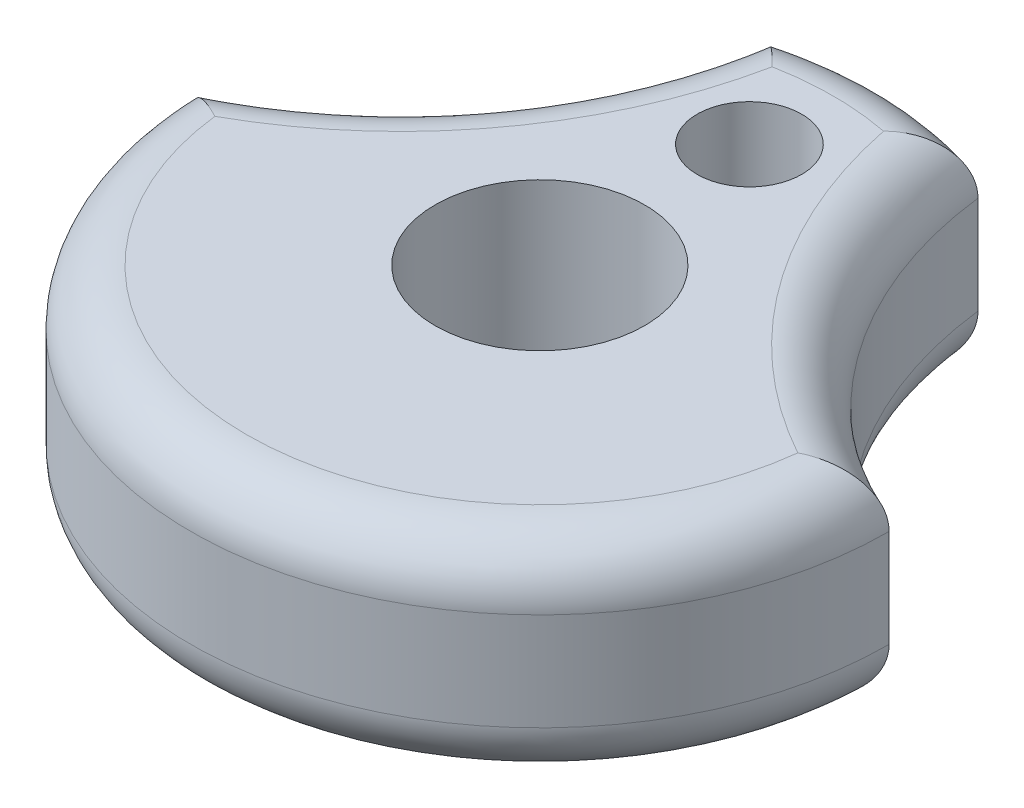
ISO-10303-21;
HEADER;
FILE_DESCRIPTION(('STEP AP214'),'2;1');
FILE_NAME('part.step','',(''),(''),'','','');
FILE_SCHEMA(('AUTOMOTIVE_DESIGN { 1 0 10303 214 1 1 1 1 }'));
ENDSEC;
DATA;
#1=APPLICATION_CONTEXT('core data for automotive mechanical design processes');
#2=APPLICATION_PROTOCOL_DEFINITION('international standard','automotive_design',2000,#1);
#3=PRODUCT_CONTEXT('',#1,'mechanical');
#4=PRODUCT('Part','Part','',(#3));
#5=PRODUCT_RELATED_PRODUCT_CATEGORY('part','',(#4));
#6=PRODUCT_DEFINITION_FORMATION('','',#4);
#7=PRODUCT_DEFINITION_CONTEXT('part definition',#1,'design');
#8=PRODUCT_DEFINITION('design','',#6,#7);
#9=PRODUCT_DEFINITION_SHAPE('','',#8);
#10=(LENGTH_UNIT() NAMED_UNIT(*) SI_UNIT(.MILLI.,.METRE.));
#11=(NAMED_UNIT(*) PLANE_ANGLE_UNIT() SI_UNIT($,.RADIAN.));
#12=(NAMED_UNIT(*) SI_UNIT($,.STERADIAN.) SOLID_ANGLE_UNIT());
#13=UNCERTAINTY_MEASURE_WITH_UNIT(LENGTH_MEASURE(1.E-05),#10,'distance_accuracy_value','');
#14=(GEOMETRIC_REPRESENTATION_CONTEXT(3) GLOBAL_UNCERTAINTY_ASSIGNED_CONTEXT((#13)) GLOBAL_UNIT_ASSIGNED_CONTEXT((#10,
#11,#12)) REPRESENTATION_CONTEXT('',''));
#15=CARTESIAN_POINT('',(0.,0.,0.));
#16=DIRECTION('',(0.,0.,1.));
#17=DIRECTION('',(1.,0.,0.));
#18=AXIS2_PLACEMENT_3D('',#15,#16,#17);
#19=CARTESIAN_POINT('',(-11.847019191903,4.7625,-8.68569425481592));
#20=DIRECTION('',(0.,1.,0.));
#21=DIRECTION('',(0.,0.,1.));
#22=AXIS2_PLACEMENT_3D('',#19,#20,#21);
#23=PLANE('',#22);
#24=CARTESIAN_POINT('',(0.,4.7625,0.));
#25=DIRECTION('',(0.,1.,0.));
#26=DIRECTION('',(0.,0.,1.));
#27=AXIS2_PLACEMENT_3D('',#24,#25,#26);
#28=CIRCLE('',#27,13.335);
#29=CARTESIAN_POINT('',(-13.247728473695,4.7625,1.52312681259641));
#30=VERTEX_POINT('',#29);
#31=CARTESIAN_POINT('',(13.247728473695,4.7625,1.52312681259641));
#32=VERTEX_POINT('',#31);
#33=EDGE_CURVE('E65',#30,#32,#28,.T.);
#34=ORIENTED_EDGE('',*,*,#33,.T.);
#35=CARTESIAN_POINT('',(23.6940383838059,4.7625,-17.3713885096318));
#36=DIRECTION('',(0.,1.,0.));
#37=DIRECTION('',(0.,0.,1.));
#38=AXIS2_PLACEMENT_3D('',#35,#36,#37);
#39=CIRCLE('',#38,21.59);
#40=CARTESIAN_POINT('',(2.53233011221546,4.7625,-13.0923462069549));
#41=VERTEX_POINT('',#40);
#42=EDGE_CURVE('E11',#32,#41,#39,.F.);
#43=ORIENTED_EDGE('',*,*,#42,.T.);
#44=CARTESIAN_POINT('',(0.,4.7625,0.));
#45=DIRECTION('',(0.,1.,0.));
#46=DIRECTION('',(0.,0.,1.));
#47=AXIS2_PLACEMENT_3D('',#44,#45,#46);
#48=CIRCLE('',#47,13.335);
#49=CARTESIAN_POINT('',(-2.53233011221546,4.7625,-13.0923462069549));
#50=VERTEX_POINT('',#49);
#51=EDGE_CURVE('E50',#41,#50,#48,.T.);
#52=ORIENTED_EDGE('',*,*,#51,.T.);
#53=CARTESIAN_POINT('',(-23.6940383838059,4.7625,-17.3713885096318));
#54=DIRECTION('',(0.,1.,0.));
#55=DIRECTION('',(0.,0.,1.));
#56=AXIS2_PLACEMENT_3D('',#53,#54,#55);
#57=CIRCLE('',#56,21.59);
#58=EDGE_CURVE('E137',#50,#30,#57,.F.);
#59=ORIENTED_EDGE('',*,*,#58,.T.);
#60=EDGE_LOOP('',(#34,#43,#52,#59));
#61=FACE_BOUND('',#60,.T.);
#62=CARTESIAN_POINT('',(0.,4.7625,0.));
#63=DIRECTION('',(0.,1.,0.));
#64=DIRECTION('',(0.,0.,1.));
#65=AXIS2_PLACEMENT_3D('',#62,#63,#64);
#66=CIRCLE('',#65,4.7625);
#67=CARTESIAN_POINT('',(0.,4.7625,4.7625));
#68=VERTEX_POINT('',#67);
#69=EDGE_CURVE('E344',#68,#68,#66,.T.);
#70=ORIENTED_EDGE('',*,*,#69,.F.);
#71=EDGE_LOOP('',(#70));
#72=FACE_BOUND('',#71,.T.);
#73=CARTESIAN_POINT('',(0.,4.7625,-9.525));
#74=DIRECTION('',(0.,1.,0.));
#75=DIRECTION('',(0.,0.,1.));
#76=AXIS2_PLACEMENT_3D('',#73,#74,#75);
#77=CIRCLE('',#76,2.3749);
#78=CARTESIAN_POINT('',(0.,4.7625,-7.1501));
#79=VERTEX_POINT('',#78);
#80=EDGE_CURVE('E350',#79,#79,#77,.T.);
#81=ORIENTED_EDGE('',*,*,#80,.F.);
#82=EDGE_LOOP('',(#81));
#83=FACE_BOUND('',#82,.T.);
#84=ADVANCED_FACE('F36',(#61,#72,#83),#23,.T.);
#85=CARTESIAN_POINT('',(-11.847019191903,-4.7625,-8.68569425481592));
#86=DIRECTION('',(0.,1.,0.));
#87=DIRECTION('',(0.,0.,1.));
#88=AXIS2_PLACEMENT_3D('',#85,#86,#87);
#89=PLANE('',#88);
#90=CARTESIAN_POINT('',(-23.6940383838059,-4.7625,-17.3713885096318));
#91=DIRECTION('',(0.,1.,0.));
#92=DIRECTION('',(0.,0.,1.));
#93=AXIS2_PLACEMENT_3D('',#90,#91,#92);
#94=CIRCLE('',#93,21.59);
#95=CARTESIAN_POINT('',(-13.247728473695,-4.7625,1.52312681259641));
#96=VERTEX_POINT('',#95);
#97=CARTESIAN_POINT('',(-2.53233011221546,-4.7625,-13.0923462069549));
#98=VERTEX_POINT('',#97);
#99=EDGE_CURVE('E149',#96,#98,#94,.T.);
#100=ORIENTED_EDGE('',*,*,#99,.T.);
#101=CARTESIAN_POINT('',(0.,-4.7625,0.));
#102=DIRECTION('',(0.,1.,0.));
#103=DIRECTION('',(0.,0.,1.));
#104=AXIS2_PLACEMENT_3D('',#101,#102,#103);
#105=CIRCLE('',#104,13.335);
#106=CARTESIAN_POINT('',(2.53233011221546,-4.7625,-13.0923462069549));
#107=VERTEX_POINT('',#106);
#108=EDGE_CURVE('E122',#98,#107,#105,.F.);
#109=ORIENTED_EDGE('',*,*,#108,.T.);
#110=CARTESIAN_POINT('',(23.6940383838059,-4.7625,-17.3713885096318));
#111=DIRECTION('',(0.,1.,0.));
#112=DIRECTION('',(0.,0.,1.));
#113=AXIS2_PLACEMENT_3D('',#110,#111,#112);
#114=CIRCLE('',#113,21.59);
#115=CARTESIAN_POINT('',(13.247728473695,-4.7625,1.52312681259641));
#116=VERTEX_POINT('',#115);
#117=EDGE_CURVE('E147',#107,#116,#114,.T.);
#118=ORIENTED_EDGE('',*,*,#117,.T.);
#119=CARTESIAN_POINT('',(0.,-4.7625,0.));
#120=DIRECTION('',(0.,1.,0.));
#121=DIRECTION('',(0.,0.,1.));
#122=AXIS2_PLACEMENT_3D('',#119,#120,#121);
#123=CIRCLE('',#122,13.335);
#124=EDGE_CURVE('E142',#116,#96,#123,.F.);
#125=ORIENTED_EDGE('',*,*,#124,.T.);
#126=EDGE_LOOP('',(#100,#109,#118,#125));
#127=FACE_BOUND('',#126,.T.);
#128=CARTESIAN_POINT('',(0.,-4.7625,0.));
#129=DIRECTION('',(0.,1.,0.));
#130=DIRECTION('',(0.,0.,1.));
#131=AXIS2_PLACEMENT_3D('',#128,#129,#130);
#132=CIRCLE('',#131,4.7625);
#133=CARTESIAN_POINT('',(0.,-4.7625,4.7625));
#134=VERTEX_POINT('',#133);
#135=EDGE_CURVE('E347',#134,#134,#132,.T.);
#136=ORIENTED_EDGE('',*,*,#135,.T.);
#137=EDGE_LOOP('',(#136));
#138=FACE_BOUND('',#137,.T.);
#139=CARTESIAN_POINT('',(0.,-4.7625,-9.525));
#140=DIRECTION('',(0.,1.,0.));
#141=DIRECTION('',(0.,0.,1.));
#142=AXIS2_PLACEMENT_3D('',#139,#140,#141);
#143=CIRCLE('',#142,2.3749);
#144=CARTESIAN_POINT('',(0.,-4.7625,-7.1501));
#145=VERTEX_POINT('',#144);
#146=EDGE_CURVE('E206',#145,#145,#143,.T.);
#147=ORIENTED_EDGE('',*,*,#146,.T.);
#148=EDGE_LOOP('',(#147));
#149=FACE_BOUND('',#148,.T.);
#150=ADVANCED_FACE('F240',(#127,#138,#149),#89,.F.);
#151=CARTESIAN_POINT('',(0.,4.7625,0.));
#152=DIRECTION('',(0.,-1.,0.));
#153=DIRECTION('',(0.,0.,-1.));
#154=AXIS2_PLACEMENT_3D('',#151,#152,#153);
#155=CYLINDRICAL_SURFACE('',#154,15.875);
#156=DIRECTION('',(0.,-1.,0.));
#157=VECTOR('',#156,1.);
#158=CARTESIAN_POINT('',(4.7752,4.7625,-15.1397850037575));
#159=LINE('',#158,#157);
#160=CARTESIAN_POINT('',(4.7752,2.2225,-15.1397850037575));
#161=VERTEX_POINT('',#160);
#162=CARTESIAN_POINT('',(4.7752,-2.2225,-15.1397850037575));
#163=VERTEX_POINT('',#162);
#164=EDGE_CURVE('E341',#161,#163,#159,.T.);
#165=ORIENTED_EDGE('',*,*,#164,.T.);
#166=CARTESIAN_POINT('',(0.,-2.2225,0.));
#167=DIRECTION('',(0.,1.,0.));
#168=DIRECTION('',(0.,0.,1.));
#169=AXIS2_PLACEMENT_3D('',#166,#167,#168);
#170=CIRCLE('',#169,15.875);
#171=CARTESIAN_POINT('',(-4.7752,-2.2225,-15.1397850037575));
#172=VERTEX_POINT('',#171);
#173=EDGE_CURVE('E132',#163,#172,#170,.T.);
#174=ORIENTED_EDGE('',*,*,#173,.T.);
#175=DIRECTION('',(0.,-1.,0.));
#176=VECTOR('',#175,1.);
#177=CARTESIAN_POINT('',(-4.7752,4.7625,-15.1397850037575));
#178=LINE('',#177,#176);
#179=CARTESIAN_POINT('',(-4.7752,2.2225,-15.1397850037575));
#180=VERTEX_POINT('',#179);
#181=EDGE_CURVE('E114',#180,#172,#178,.T.);
#182=ORIENTED_EDGE('',*,*,#181,.F.);
#183=CARTESIAN_POINT('',(0.,2.2225,0.));
#184=DIRECTION('',(0.,1.,0.));
#185=DIRECTION('',(0.,0.,1.));
#186=AXIS2_PLACEMENT_3D('',#183,#184,#185);
#187=CIRCLE('',#186,15.875);
#188=EDGE_CURVE('E129',#180,#161,#187,.F.);
#189=ORIENTED_EDGE('',*,*,#188,.T.);
#190=EDGE_LOOP('',(#165,#174,#182,#189));
#191=FACE_BOUND('',#190,.T.);
#192=ADVANCED_FACE('F127',(#191),#155,.T.);
#193=CARTESIAN_POINT('',(-23.6940383838059,4.7625,-17.3713885096318));
#194=DIRECTION('',(0.,-1.,0.));
#195=DIRECTION('',(0.,0.,-1.));
#196=AXIS2_PLACEMENT_3D('',#193,#194,#195);
#197=CYLINDRICAL_SURFACE('',#196,19.05);
#198=ORIENTED_EDGE('',*,*,#181,.T.);
#199=CARTESIAN_POINT('',(-23.6940383838059,-2.2225,-17.3713885096318));
#200=DIRECTION('',(0.,1.,0.));
#201=DIRECTION('',(0.,0.,1.));
#202=AXIS2_PLACEMENT_3D('',#199,#200,#201);
#203=CIRCLE('',#202,19.05);
#204=CARTESIAN_POINT('',(-15.875,-2.2225,0.));
#205=VERTEX_POINT('',#204);
#206=EDGE_CURVE('E121',#172,#205,#203,.F.);
#207=ORIENTED_EDGE('',*,*,#206,.T.);
#208=DIRECTION('',(0.,-1.,0.));
#209=VECTOR('',#208,1.);
#210=CARTESIAN_POINT('',(-15.875,4.7625,0.));
#211=LINE('',#210,#209);
#212=CARTESIAN_POINT('',(-15.875,2.2225,0.));
#213=VERTEX_POINT('',#212);
#214=EDGE_CURVE('E116',#213,#205,#211,.T.);
#215=ORIENTED_EDGE('',*,*,#214,.F.);
#216=CARTESIAN_POINT('',(-23.6940383838059,2.2225,-17.3713885096318));
#217=DIRECTION('',(0.,1.,0.));
#218=DIRECTION('',(0.,0.,1.));
#219=AXIS2_PLACEMENT_3D('',#216,#217,#218);
#220=CIRCLE('',#219,19.05);
#221=EDGE_CURVE('E111',#213,#180,#220,.T.);
#222=ORIENTED_EDGE('',*,*,#221,.T.);
#223=EDGE_LOOP('',(#198,#207,#215,#222));
#224=FACE_BOUND('',#223,.T.);
#225=ADVANCED_FACE('F113',(#224),#197,.F.);
#226=CARTESIAN_POINT('',(0.,4.7625,0.));
#227=DIRECTION('',(0.,-1.,0.));
#228=DIRECTION('',(0.,0.,-1.));
#229=AXIS2_PLACEMENT_3D('',#226,#227,#228);
#230=CYLINDRICAL_SURFACE('',#229,15.875);
#231=ORIENTED_EDGE('',*,*,#214,.T.);
#232=CARTESIAN_POINT('',(0.,-2.2225,0.));
#233=DIRECTION('',(0.,1.,0.));
#234=DIRECTION('',(0.,0.,1.));
#235=AXIS2_PLACEMENT_3D('',#232,#233,#234);
#236=CIRCLE('',#235,15.875);
#237=CARTESIAN_POINT('',(15.875,-2.2225,0.));
#238=VERTEX_POINT('',#237);
#239=EDGE_CURVE('E161',#205,#238,#236,.T.);
#240=ORIENTED_EDGE('',*,*,#239,.T.);
#241=DIRECTION('',(0.,-1.,0.));
#242=VECTOR('',#241,1.);
#243=CARTESIAN_POINT('',(15.875,4.7625,0.));
#244=LINE('',#243,#242);
#245=CARTESIAN_POINT('',(15.875,2.2225,0.));
#246=VERTEX_POINT('',#245);
#247=EDGE_CURVE('E339',#246,#238,#244,.T.);
#248=ORIENTED_EDGE('',*,*,#247,.F.);
#249=CARTESIAN_POINT('',(0.,2.2225,0.));
#250=DIRECTION('',(0.,1.,0.));
#251=DIRECTION('',(0.,0.,1.));
#252=AXIS2_PLACEMENT_3D('',#249,#250,#251);
#253=CIRCLE('',#252,15.875);
#254=EDGE_CURVE('E159',#246,#213,#253,.F.);
#255=ORIENTED_EDGE('',*,*,#254,.T.);
#256=EDGE_LOOP('',(#231,#240,#248,#255));
#257=FACE_BOUND('',#256,.T.);
#258=ADVANCED_FACE('F255',(#257),#230,.T.);
#259=CARTESIAN_POINT('',(23.6940383838059,4.7625,-17.3713885096318));
#260=DIRECTION('',(0.,-1.,0.));
#261=DIRECTION('',(0.,0.,-1.));
#262=AXIS2_PLACEMENT_3D('',#259,#260,#261);
#263=CYLINDRICAL_SURFACE('',#262,19.05);
#264=ORIENTED_EDGE('',*,*,#247,.T.);
#265=CARTESIAN_POINT('',(23.6940383838059,-2.2225,-17.3713885096318));
#266=DIRECTION('',(0.,1.,0.));
#267=DIRECTION('',(0.,0.,1.));
#268=AXIS2_PLACEMENT_3D('',#265,#266,#267);
#269=CIRCLE('',#268,19.05);
#270=EDGE_CURVE('E157',#238,#163,#269,.F.);
#271=ORIENTED_EDGE('',*,*,#270,.T.);
#272=ORIENTED_EDGE('',*,*,#164,.F.);
#273=CARTESIAN_POINT('',(23.6940383838059,2.2225,-17.3713885096318));
#274=DIRECTION('',(0.,1.,0.));
#275=DIRECTION('',(0.,0.,1.));
#276=AXIS2_PLACEMENT_3D('',#273,#274,#275);
#277=CIRCLE('',#276,19.05);
#278=EDGE_CURVE('E154',#161,#246,#277,.T.);
#279=ORIENTED_EDGE('',*,*,#278,.T.);
#280=EDGE_LOOP('',(#264,#271,#272,#279));
#281=FACE_BOUND('',#280,.T.);
#282=ADVANCED_FACE('F252',(#281),#263,.F.);
#283=CARTESIAN_POINT('',(0.,4.7625,0.));
#284=DIRECTION('',(0.,-1.,0.));
#285=DIRECTION('',(0.,0.,-1.));
#286=AXIS2_PLACEMENT_3D('',#283,#284,#285);
#287=CYLINDRICAL_SURFACE('',#286,4.7625);
#288=ORIENTED_EDGE('',*,*,#69,.T.);
#289=EDGE_LOOP('',(#288));
#290=FACE_BOUND('',#289,.T.);
#291=ORIENTED_EDGE('',*,*,#135,.F.);
#292=EDGE_LOOP('',(#291));
#293=FACE_BOUND('',#292,.T.);
#294=ADVANCED_FACE('F249',(#290,#293),#287,.F.);
#295=CARTESIAN_POINT('',(0.,4.7625,-9.525));
#296=DIRECTION('',(0.,-1.,0.));
#297=DIRECTION('',(0.,0.,-1.));
#298=AXIS2_PLACEMENT_3D('',#295,#296,#297);
#299=CYLINDRICAL_SURFACE('',#298,2.3749);
#300=ORIENTED_EDGE('',*,*,#80,.T.);
#301=EDGE_LOOP('',(#300));
#302=FACE_BOUND('',#301,.T.);
#303=ORIENTED_EDGE('',*,*,#146,.F.);
#304=EDGE_LOOP('',(#303));
#305=FACE_BOUND('',#304,.T.);
#306=ADVANCED_FACE('F285',(#302,#305),#299,.F.);
#307=CARTESIAN_POINT('',(0.,-2.2225,0.));
#308=DIRECTION('',(0.,1.,0.));
#309=DIRECTION('',(0.,0.,1.));
#310=AXIS2_PLACEMENT_3D('',#307,#308,#309);
#311=TOROIDAL_SURFACE('',#310,13.335,2.54);
#312=CARTESIAN_POINT('',(-15.875,-2.2225,0.));
#313=CARTESIAN_POINT('',(-15.87501070676,-2.28576242028002,-8.75287829129136E-06));
#314=CARTESIAN_POINT('',(-15.8726368371856,-2.34901793293338,0.00152779028974985));
#315=CARTESIAN_POINT('',(-15.8632022907035,-2.47500788695464,0.00762485279574024));
#316=CARTESIAN_POINT('',(-15.8561434325438,-2.53774252096633,0.0121841986580825));
#317=CARTESIAN_POINT('',(-15.837466257091,-2.66193328076446,0.0242312426535005));
#318=CARTESIAN_POINT('',(-15.8258700801112,-2.72339411144454,0.0317047203800411));
#319=CARTESIAN_POINT('',(-15.7982790541074,-2.84489327909863,0.0494511058090318));
#320=CARTESIAN_POINT('',(-15.782283964497,-2.90493153807385,0.0597241666267113));
#321=CARTESIAN_POINT('',(-15.7280148632912,-3.08215575111746,0.0944933612027994));
#322=CARTESIAN_POINT('',(-15.6834172970506,-3.19670928073866,0.122965372854319));
#323=CARTESIAN_POINT('',(-15.5793092066205,-3.41600137931814,0.188938936892085));
#324=CARTESIAN_POINT('',(-15.5197836059694,-3.52072987773149,0.226449616307283));
#325=CARTESIAN_POINT('',(-15.3841042679165,-3.72445286129146,0.311178205735003));
#326=CARTESIAN_POINT('',(-15.307178225793,-3.82274738782864,0.358837417060436));
#327=CARTESIAN_POINT('',(-15.1415790379963,-4.00515335364544,0.460295027365002));
#328=CARTESIAN_POINT('',(-15.0529036056685,-4.08926202482704,0.514094621096068));
#329=CARTESIAN_POINT('',(-14.8520151637709,-4.25431394355265,0.63446341959562));
#330=CARTESIAN_POINT('',(-14.7382683001498,-4.33287543600797,0.701735843344731));
#331=CARTESIAN_POINT('',(-14.5012348225151,-4.47030593451395,0.83971986401395));
#332=CARTESIAN_POINT('',(-14.3779355584637,-4.52914825849498,0.910435973690849));
#333=CARTESIAN_POINT('',(-14.0929301847369,-4.63936348651171,1.07113293179449));
#334=CARTESIAN_POINT('',(-13.9293138118187,-4.68521486608128,1.16152043095165));
#335=CARTESIAN_POINT('',(-13.5963386439126,-4.74647142691469,1.34130956129154));
#336=CARTESIAN_POINT('',(-13.426992555464,-4.7619399942369,1.43071285718771));
#337=CARTESIAN_POINT('',(-13.2539405057964,-4.76249502843172,1.51992642710618));
#338=CARTESIAN_POINT('',(-13.2508345825529,-4.76250000556001,1.52152692313992));
#339=CARTESIAN_POINT('',(-13.247728473695,-4.7625,1.52312681259641));
#340=B_SPLINE_CURVE_WITH_KNOTS('',3,(#312,#313,#314,#315,#316,#317,#318,#319,#320,#321,#322,
#323,#324,#325,#326,#327,#328,#329,#330,#331,#332,#333,#334,#335,#336,#337,#338,#339),
.UNSPECIFIED.,.F.,.F.,(4,2,2,2,2,2,2,2,2,2,2,2,2,4),(0.,0.18971259738573,0.379351589950053,
0.568076533796606,0.756811801489073,1.13350507465966,1.51058032948155,1.90984235734349,
2.3091822036345,2.76862657203191,3.22869012933075,3.80347651116089,4.37706246741576,
4.38754459436644),.UNSPECIFIED.);
#341=EDGE_CURVE('E207',#96,#205,#340,.F.);
#342=ORIENTED_EDGE('',*,*,#341,.F.);
#343=ORIENTED_EDGE('',*,*,#124,.F.);
#344=CARTESIAN_POINT('',(15.875,-2.2225,0.));
#345=CARTESIAN_POINT('',(15.87501070676,-2.28576242028002,-8.75287828454174E-06));
#346=CARTESIAN_POINT('',(15.8726368371856,-2.34901793293338,0.00152779028975689));
#347=CARTESIAN_POINT('',(15.8632022907035,-2.47500788695464,0.00762485279574301));
#348=CARTESIAN_POINT('',(15.8561434325438,-2.53774252096633,0.0121841986580807));
#349=CARTESIAN_POINT('',(15.837466257091,-2.66193328076446,0.024231242653497));
#350=CARTESIAN_POINT('',(15.8258700801112,-2.72339411144455,0.0317047203800404));
#351=CARTESIAN_POINT('',(15.7982790541074,-2.84489327909863,0.0494511058090328));
#352=CARTESIAN_POINT('',(15.782283964497,-2.90493153807385,0.0597241666267113));
#353=CARTESIAN_POINT('',(15.7280148632912,-3.08215575111746,0.0944933612027979));
#354=CARTESIAN_POINT('',(15.6834172970506,-3.19670928073866,0.122965372854318));
#355=CARTESIAN_POINT('',(15.5793092066205,-3.41600137931814,0.188938936892085));
#356=CARTESIAN_POINT('',(15.5197836059694,-3.52072987773149,0.226449616307283));
#357=CARTESIAN_POINT('',(15.3841042679165,-3.72445286129147,0.311178205735002));
#358=CARTESIAN_POINT('',(15.307178225793,-3.82274738782864,0.358837417060435));
#359=CARTESIAN_POINT('',(15.1415790379963,-4.00515335364544,0.460295027365004));
#360=CARTESIAN_POINT('',(15.0529036056685,-4.08926202482704,0.514094621096073));
#361=CARTESIAN_POINT('',(14.8520151637709,-4.25431394355265,0.634463419595615));
#362=CARTESIAN_POINT('',(14.7382683001498,-4.33287543600797,0.701735843344707));
#363=CARTESIAN_POINT('',(14.5012348225151,-4.47030593451395,0.839719864013961));
#364=CARTESIAN_POINT('',(14.3779355584637,-4.52914825849498,0.910435973690912));
#365=CARTESIAN_POINT('',(14.0929301847369,-4.63936348651171,1.07113293179441));
#366=CARTESIAN_POINT('',(13.9293138118185,-4.68521486608128,1.16152043095131));
#367=CARTESIAN_POINT('',(13.5963386439128,-4.7464714269147,1.34130956129189));
#368=CARTESIAN_POINT('',(13.4269925554646,-4.76193999423692,1.43071285718901));
#369=CARTESIAN_POINT('',(13.2539405057964,-4.76249502843172,1.51992642710623));
#370=CARTESIAN_POINT('',(13.2508345825529,-4.76250000556001,1.52152692313994));
#371=CARTESIAN_POINT('',(13.247728473695,-4.7625,1.52312681259641));
#372=B_SPLINE_CURVE_WITH_KNOTS('',3,(#344,#345,#346,#347,#348,#349,#350,#351,#352,#353,#354,
#355,#356,#357,#358,#359,#360,#361,#362,#363,#364,#365,#366,#367,#368,#369,#370,#371),
.UNSPECIFIED.,.F.,.F.,(4,2,2,2,2,2,2,2,2,2,2,2,2,4),(0.,0.189712597385731,0.379351589950054,
0.568076533796606,0.756811801489073,1.13350507465966,1.51058032948155,1.9098423573435,
2.3091822036345,2.76862657203189,3.22869012933075,3.80347651116091,4.37706246741576,
4.38754459436644),.UNSPECIFIED.);
#373=EDGE_CURVE('E199',#238,#116,#372,.T.);
#374=ORIENTED_EDGE('',*,*,#373,.F.);
#375=ORIENTED_EDGE('',*,*,#239,.F.);
#376=EDGE_LOOP('',(#342,#343,#374,#375));
#377=FACE_BOUND('',#376,.T.);
#378=ADVANCED_FACE('F193',(#377),#311,.T.);
#379=CARTESIAN_POINT('',(23.6940383838059,-2.2225,-17.3713885096318));
#380=DIRECTION('',(0.,1.,0.));
#381=DIRECTION('',(0.,0.,1.));
#382=AXIS2_PLACEMENT_3D('',#379,#380,#381);
#383=TOROIDAL_SURFACE('',#382,21.59,2.54);
#384=ORIENTED_EDGE('',*,*,#373,.T.);
#385=ORIENTED_EDGE('',*,*,#117,.F.);
#386=CARTESIAN_POINT('',(4.7752,-2.2225,-15.1397850037575));
#387=CARTESIAN_POINT('',(4.77521156810179,-2.28576242028002,-15.1397925817922));
#388=CARTESIAN_POINT('',(4.77303212651408,-2.34901793293338,-15.1379908448443));
#389=CARTESIAN_POINT('',(4.76437952419241,-2.47500788695464,-15.13082723461));
#390=CARTESIAN_POINT('',(4.75790802966656,-2.53774252096633,-15.125466742859));
#391=CARTESIAN_POINT('',(4.74080082310004,-2.66193328076446,-15.1112783097034));
#392=CARTESIAN_POINT('',(4.73018533268593,-2.72339411144455,-15.1024672057349));
#393=CARTESIAN_POINT('',(4.70496145064737,-2.84489327909863,-15.0814921089141));
#394=CARTESIAN_POINT('',(4.69035284063048,-2.90493153807385,-15.0693279326746));
#395=CARTESIAN_POINT('',(4.64086975762491,-3.08215575111746,-15.0280307568219));
#396=CARTESIAN_POINT('',(4.60030141536723,-3.19670928073866,-14.9940630078747));
#397=CARTESIAN_POINT('',(4.50606755527997,-3.41600137931814,-14.9146212980625));
#398=CARTESIAN_POINT('',(4.45238879811964,-3.52072987773149,-14.8691357043784));
#399=CARTESIAN_POINT('',(4.33077187826594,-3.72445286129147,-14.7652264100579));
#400=CARTESIAN_POINT('',(4.26218054287924,-3.82274738782865,-14.7061989156945));
#401=CARTESIAN_POINT('',(4.11560947840222,-4.00515335364544,-14.5787875318009));
#402=CARTESIAN_POINT('',(4.03762792206649,-4.08926202482704,-14.5104018208986));
#403=CARTESIAN_POINT('',(3.86240649099921,-4.25431394355265,-14.3550240109159));
#404=CARTESIAN_POINT('',(3.76403458199723,-4.33287543600797,-14.2667806230615));
#405=CARTESIAN_POINT('',(3.5611413114909,-4.47030593451395,-14.0822304123792));
#406=CARTESIAN_POINT('',(3.45661184109659,-4.52914825849498,-13.9859128828088));
#407=CARTESIAN_POINT('',(3.2176275855335,-4.63936348651171,-13.7624445383171));
#408=CARTESIAN_POINT('',(3.08221037556686,-4.68521486608128,-13.6335942502474));
#409=CARTESIAN_POINT('',(2.81058884478523,-4.7464714269147,-13.3701206503435));
#410=CARTESIAN_POINT('',(2.67438675848127,-4.76193999423692,-13.2355099573195));
#411=CARTESIAN_POINT('',(2.53725085829046,-4.76249502843172,-13.097307866776));
#412=CARTESIAN_POINT('',(2.53479022392687,-4.76250000556001,-13.0948272166037));
#413=CARTESIAN_POINT('',(2.53233011221546,-4.7625,-13.0923462069549));
#414=B_SPLINE_CURVE_WITH_KNOTS('',3,(#386,#387,#388,#389,#390,#391,#392,#393,#394,#395,#396,
#397,#398,#399,#400,#401,#402,#403,#404,#405,#406,#407,#408,#409,#410,#411,#412,#413),
.UNSPECIFIED.,.F.,.F.,(4,2,2,2,2,2,2,2,2,2,2,2,2,4),(0.,0.189712597385731,0.379351589950055,
0.568076533796607,0.756811801489075,1.13350507465966,1.51058032948155,1.9098423573435,
2.3091822036345,2.76862657203189,3.22869012933075,3.80347651116093,4.37706246741575,
4.38754459436644),.UNSPECIFIED.);
#415=EDGE_CURVE('E174',#163,#107,#414,.T.);
#416=ORIENTED_EDGE('',*,*,#415,.F.);
#417=ORIENTED_EDGE('',*,*,#270,.F.);
#418=EDGE_LOOP('',(#384,#385,#416,#417));
#419=FACE_BOUND('',#418,.T.);
#420=ADVANCED_FACE('F188',(#419),#383,.T.);
#421=CARTESIAN_POINT('',(-23.6940383838059,-2.2225,-17.3713885096318));
#422=DIRECTION('',(0.,1.,0.));
#423=DIRECTION('',(0.,0.,1.));
#424=AXIS2_PLACEMENT_3D('',#421,#422,#423);
#425=TOROIDAL_SURFACE('',#424,21.59,2.54);
#426=ORIENTED_EDGE('',*,*,#341,.T.);
#427=ORIENTED_EDGE('',*,*,#206,.F.);
#428=CARTESIAN_POINT('',(-4.7752,-2.2225,-15.1397850037575));
#429=CARTESIAN_POINT('',(-4.77521156810179,-2.28576242028002,-15.1397925817922));
#430=CARTESIAN_POINT('',(-4.77303212651408,-2.34901793293338,-15.1379908448443));
#431=CARTESIAN_POINT('',(-4.76437952419241,-2.47500788695464,-15.13082723461));
#432=CARTESIAN_POINT('',(-4.75790802966656,-2.53774252096633,-15.125466742859));
#433=CARTESIAN_POINT('',(-4.74080082310004,-2.66193328076446,-15.1112783097034));
#434=CARTESIAN_POINT('',(-4.73018533268592,-2.72339411144454,-15.1024672057349));
#435=CARTESIAN_POINT('',(-4.70496145064736,-2.84489327909863,-15.0814921089141));
#436=CARTESIAN_POINT('',(-4.69035284063048,-2.90493153807385,-15.0693279326746));
#437=CARTESIAN_POINT('',(-4.64086975762492,-3.08215575111746,-15.0280307568219));
#438=CARTESIAN_POINT('',(-4.60030141536723,-3.19670928073865,-14.9940630078748));
#439=CARTESIAN_POINT('',(-4.50606755527997,-3.41600137931813,-14.9146212980625));
#440=CARTESIAN_POINT('',(-4.45238879811964,-3.52072987773149,-14.8691357043784));
#441=CARTESIAN_POINT('',(-4.33077187826594,-3.72445286129146,-14.7652264100579));
#442=CARTESIAN_POINT('',(-4.26218054287924,-3.82274738782864,-14.7061989156945));
#443=CARTESIAN_POINT('',(-4.11560947840222,-4.00515335364544,-14.5787875318009));
#444=CARTESIAN_POINT('',(-4.03762792206649,-4.08926202482704,-14.5104018208986));
#445=CARTESIAN_POINT('',(-3.86240649099922,-4.25431394355265,-14.3550240109159));
#446=CARTESIAN_POINT('',(-3.76403458199723,-4.33287543600797,-14.2667806230615));
#447=CARTESIAN_POINT('',(-3.5611413114909,-4.47030593451395,-14.0822304123792));
#448=CARTESIAN_POINT('',(-3.45661184109659,-4.52914825849497,-13.9859128828088));
#449=CARTESIAN_POINT('',(-3.2176275855335,-4.63936348651171,-13.7624445383171));
#450=CARTESIAN_POINT('',(-3.08221037556685,-4.68521486608128,-13.6335942502474));
#451=CARTESIAN_POINT('',(-2.81058884478523,-4.7464714269147,-13.3701206503435));
#452=CARTESIAN_POINT('',(-2.67438675848127,-4.76193999423692,-13.2355099573195));
#453=CARTESIAN_POINT('',(-2.53725085829046,-4.76249502843172,-13.097307866776));
#454=CARTESIAN_POINT('',(-2.53479022392687,-4.76250000556001,-13.0948272166037));
#455=CARTESIAN_POINT('',(-2.53233011221546,-4.7625,-13.0923462069549));
#456=B_SPLINE_CURVE_WITH_KNOTS('',3,(#428,#429,#430,#431,#432,#433,#434,#435,#436,#437,#438,
#439,#440,#441,#442,#443,#444,#445,#446,#447,#448,#449,#450,#451,#452,#453,#454,#455),
.UNSPECIFIED.,.F.,.F.,(4,2,2,2,2,2,2,2,2,2,2,2,2,4),(0.,0.189712597385731,0.379351589950054,
0.568076533796605,0.756811801489072,1.13350507465966,1.51058032948155,1.9098423573435,
2.3091822036345,2.76862657203189,3.22869012933075,3.80347651116093,4.37706246741575,
4.38754459436644),.UNSPECIFIED.);
#457=EDGE_CURVE('E166',#98,#172,#456,.F.);
#458=ORIENTED_EDGE('',*,*,#457,.F.);
#459=ORIENTED_EDGE('',*,*,#99,.F.);
#460=EDGE_LOOP('',(#426,#427,#458,#459));
#461=FACE_BOUND('',#460,.T.);
#462=ADVANCED_FACE('F181',(#461),#425,.T.);
#463=CARTESIAN_POINT('',(0.,-2.2225,0.));
#464=DIRECTION('',(0.,1.,0.));
#465=DIRECTION('',(0.,0.,1.));
#466=AXIS2_PLACEMENT_3D('',#463,#464,#465);
#467=TOROIDAL_SURFACE('',#466,13.335,2.54);
#468=ORIENTED_EDGE('',*,*,#415,.T.);
#469=ORIENTED_EDGE('',*,*,#108,.F.);
#470=ORIENTED_EDGE('',*,*,#457,.T.);
#471=ORIENTED_EDGE('',*,*,#173,.F.);
#472=EDGE_LOOP('',(#468,#469,#470,#471));
#473=FACE_BOUND('',#472,.T.);
#474=ADVANCED_FACE('F184',(#473),#467,.T.);
#475=CARTESIAN_POINT('',(-23.6940383838059,2.2225,-17.3713885096318));
#476=DIRECTION('',(0.,1.,0.));
#477=DIRECTION('',(0.,0.,1.));
#478=AXIS2_PLACEMENT_3D('',#475,#476,#477);
#479=TOROIDAL_SURFACE('',#478,21.59,2.54);
#480=CARTESIAN_POINT('',(-4.7752,2.2225,-15.1397850037575));
#481=CARTESIAN_POINT('',(-4.77521156810179,2.28576242028002,-15.1397925817922));
#482=CARTESIAN_POINT('',(-4.77303212651408,2.34901793293338,-15.1379908448443));
#483=CARTESIAN_POINT('',(-4.76437952419241,2.47500788695464,-15.13082723461));
#484=CARTESIAN_POINT('',(-4.75790802966656,2.53774252096633,-15.125466742859));
#485=CARTESIAN_POINT('',(-4.74080082310004,2.66193328076446,-15.1112783097034));
#486=CARTESIAN_POINT('',(-4.73018533268592,2.72339411144454,-15.1024672057349));
#487=CARTESIAN_POINT('',(-4.70496145064736,2.84489327909863,-15.0814921089141));
#488=CARTESIAN_POINT('',(-4.69035284063048,2.90493153807385,-15.0693279326746));
#489=CARTESIAN_POINT('',(-4.64086975762492,3.08215575111746,-15.0280307568219));
#490=CARTESIAN_POINT('',(-4.60030141536723,3.19670928073866,-14.9940630078747));
#491=CARTESIAN_POINT('',(-4.50606755527997,3.41600137931814,-14.9146212980625));
#492=CARTESIAN_POINT('',(-4.45238879811964,3.52072987773149,-14.8691357043784));
#493=CARTESIAN_POINT('',(-4.33077187826594,3.72445286129146,-14.7652264100579));
#494=CARTESIAN_POINT('',(-4.26218054287924,3.82274738782864,-14.7061989156945));
#495=CARTESIAN_POINT('',(-4.11560947840222,4.00515335364544,-14.5787875318009));
#496=CARTESIAN_POINT('',(-4.0376279220665,4.08926202482704,-14.5104018208986));
#497=CARTESIAN_POINT('',(-3.86240649099921,4.25431394355265,-14.3550240109159));
#498=CARTESIAN_POINT('',(-3.7640345819972,4.33287543600797,-14.2667806230615));
#499=CARTESIAN_POINT('',(-3.56114131149092,4.47030593451396,-14.0822304123791));
#500=CARTESIAN_POINT('',(-3.45661184109668,4.52914825849498,-13.9859128828087));
#501=CARTESIAN_POINT('',(-3.2176275855334,4.63936348651171,-13.7624445383172));
#502=CARTESIAN_POINT('',(-3.0822103755664,4.68521486608127,-13.6335942502479));
#503=CARTESIAN_POINT('',(-2.81058884478573,4.74647142691469,-13.370120650343));
#504=CARTESIAN_POINT('',(-2.67438675848306,4.76193999423692,-13.2355099573177));
#505=CARTESIAN_POINT('',(-2.53725085829052,4.76249502843172,-13.0973078667759));
#506=CARTESIAN_POINT('',(-2.5347902239269,4.76250000556001,-13.0948272166037));
#507=CARTESIAN_POINT('',(-2.53233011221546,4.7625,-13.0923462069549));
#508=B_SPLINE_CURVE_WITH_KNOTS('',3,(#480,#481,#482,#483,#484,#485,#486,#487,#488,#489,#490,
#491,#492,#493,#494,#495,#496,#497,#498,#499,#500,#501,#502,#503,#504,#505,#506,#507),
.UNSPECIFIED.,.F.,.F.,(4,2,2,2,2,2,2,2,2,2,2,2,2,4),(0.,0.18971259738573,0.379351589950054,
0.568076533796605,0.756811801489072,1.13350507465966,1.51058032948155,1.90984235734349,
2.3091822036345,2.7686265720319,3.22869012933075,3.80347651116089,4.37706246741576,
4.38754459436644),.UNSPECIFIED.);
#509=EDGE_CURVE('E136',#180,#50,#508,.T.);
#510=ORIENTED_EDGE('',*,*,#509,.F.);
#511=ORIENTED_EDGE('',*,*,#221,.F.);
#512=CARTESIAN_POINT('',(-15.875,2.2225,0.));
#513=CARTESIAN_POINT('',(-15.87501070676,2.28576242028002,-8.75287829055332E-06));
#514=CARTESIAN_POINT('',(-15.8726368371856,2.34901793293338,0.00152779028975057));
#515=CARTESIAN_POINT('',(-15.8632022907035,2.47500788695464,0.00762485279574058));
#516=CARTESIAN_POINT('',(-15.8561434325438,2.53774252096633,0.0121841986580825));
#517=CARTESIAN_POINT('',(-15.837466257091,2.66193328076446,0.0242312426535006));
#518=CARTESIAN_POINT('',(-15.8258700801112,2.72339411144455,0.0317047203800417));
#519=CARTESIAN_POINT('',(-15.7982790541074,2.84489327909863,0.0494511058090325));
#520=CARTESIAN_POINT('',(-15.782283964497,2.90493153807385,0.0597241666267117));
#521=CARTESIAN_POINT('',(-15.7280148632912,3.08215575111746,0.0944933612027994));
#522=CARTESIAN_POINT('',(-15.6834172970506,3.19670928073866,0.122965372854319));
#523=CARTESIAN_POINT('',(-15.5793092066205,3.41600137931814,0.188938936892087));
#524=CARTESIAN_POINT('',(-15.5197836059694,3.52072987773149,0.226449616307285));
#525=CARTESIAN_POINT('',(-15.3841042679165,3.72445286129147,0.311178205735004));
#526=CARTESIAN_POINT('',(-15.307178225793,3.82274738782864,0.358837417060436));
#527=CARTESIAN_POINT('',(-15.1415790379963,4.00515335364544,0.460295027365));
#528=CARTESIAN_POINT('',(-15.0529036056685,4.08926202482704,0.514094621096067));
#529=CARTESIAN_POINT('',(-14.8520151637709,4.25431394355265,0.63446341959562));
#530=CARTESIAN_POINT('',(-14.7382683001498,4.33287543600797,0.70173584334473));
#531=CARTESIAN_POINT('',(-14.5012348225151,4.47030593451396,0.839719864013949));
#532=CARTESIAN_POINT('',(-14.3779355584637,4.52914825849498,0.910435973690849));
#533=CARTESIAN_POINT('',(-14.0929301847369,4.63936348651171,1.07113293179448));
#534=CARTESIAN_POINT('',(-13.9293138118187,4.68521486608127,1.16152043095165));
#535=CARTESIAN_POINT('',(-13.5963386439126,4.74647142691469,1.34130956129154));
#536=CARTESIAN_POINT('',(-13.426992555464,4.76193999423692,1.43071285718772));
#537=CARTESIAN_POINT('',(-13.2539405057964,4.76249502843172,1.51992642710618));
#538=CARTESIAN_POINT('',(-13.2508345825529,4.76250000556001,1.52152692313992));
#539=CARTESIAN_POINT('',(-13.247728473695,4.7625,1.52312681259641));
#540=B_SPLINE_CURVE_WITH_KNOTS('',3,(#512,#513,#514,#515,#516,#517,#518,#519,#520,#521,#522,
#523,#524,#525,#526,#527,#528,#529,#530,#531,#532,#533,#534,#535,#536,#537,#538,#539),
.UNSPECIFIED.,.F.,.F.,(4,2,2,2,2,2,2,2,2,2,2,2,2,4),(0.,0.189712597385731,0.379351589950054,
0.568076533796606,0.756811801489074,1.13350507465966,1.51058032948155,1.90984235734349,
2.3091822036345,2.76862657203191,3.22869012933076,3.80347651116089,4.37706246741576,
4.38754459436644),.UNSPECIFIED.);
#541=EDGE_CURVE('E41',#30,#213,#540,.F.);
#542=ORIENTED_EDGE('',*,*,#541,.F.);
#543=ORIENTED_EDGE('',*,*,#58,.F.);
#544=EDGE_LOOP('',(#510,#511,#542,#543));
#545=FACE_BOUND('',#544,.T.);
#546=ADVANCED_FACE('F38',(#545),#479,.T.);
#547=CARTESIAN_POINT('',(0.,2.2225,0.));
#548=DIRECTION('',(0.,1.,0.));
#549=DIRECTION('',(0.,0.,1.));
#550=AXIS2_PLACEMENT_3D('',#547,#548,#549);
#551=TOROIDAL_SURFACE('',#550,13.335,2.54);
#552=ORIENTED_EDGE('',*,*,#541,.T.);
#553=ORIENTED_EDGE('',*,*,#254,.F.);
#554=CARTESIAN_POINT('',(15.875,2.2225,0.));
#555=CARTESIAN_POINT('',(15.87501070676,2.28576242028002,-8.7528782921426E-06));
#556=CARTESIAN_POINT('',(15.8726368371856,2.34901793293338,0.00152779028974944));
#557=CARTESIAN_POINT('',(15.8632022907035,2.47500788695464,0.00762485279574009));
#558=CARTESIAN_POINT('',(15.8561434325438,2.53774252096633,0.0121841986580822));
#559=CARTESIAN_POINT('',(15.837466257091,2.66193328076446,0.0242312426535003));
#560=CARTESIAN_POINT('',(15.8258700801112,2.72339411144455,0.0317047203800412));
#561=CARTESIAN_POINT('',(15.7982790541074,2.84489327909863,0.0494511058090317));
#562=CARTESIAN_POINT('',(15.782283964497,2.90493153807385,0.059724166626711));
#563=CARTESIAN_POINT('',(15.7280148632912,3.08215575111746,0.0944933612027987));
#564=CARTESIAN_POINT('',(15.6834172970506,3.19670928073866,0.122965372854318));
#565=CARTESIAN_POINT('',(15.5793092066205,3.41600137931814,0.188938936892085));
#566=CARTESIAN_POINT('',(15.5197836059694,3.52072987773149,0.226449616307283));
#567=CARTESIAN_POINT('',(15.3841042679165,3.72445286129147,0.311178205735005));
#568=CARTESIAN_POINT('',(15.307178225793,3.82274738782865,0.358837417060439));
#569=CARTESIAN_POINT('',(15.1415790379963,4.00515335364544,0.460295027365006));
#570=CARTESIAN_POINT('',(15.0529036056685,4.08926202482704,0.514094621096071));
#571=CARTESIAN_POINT('',(14.8520151637709,4.25431394355265,0.634463419595613));
#572=CARTESIAN_POINT('',(14.7382683001498,4.33287543600797,0.701735843344712));
#573=CARTESIAN_POINT('',(14.5012348225151,4.47030593451395,0.839719864013965));
#574=CARTESIAN_POINT('',(14.3779355584637,4.52914825849498,0.910435973690911));
#575=CARTESIAN_POINT('',(14.0929301847369,4.63936348651171,1.07113293179441));
#576=CARTESIAN_POINT('',(13.9293138118185,4.68521486608128,1.16152043095132));
#577=CARTESIAN_POINT('',(13.5963386439127,4.7464714269147,1.34130956129188));
#578=CARTESIAN_POINT('',(13.4269925554646,4.76193999423692,1.43071285718897));
#579=CARTESIAN_POINT('',(13.2539405057964,4.76249502843172,1.51992642710623));
#580=CARTESIAN_POINT('',(13.2508345825529,4.76250000556001,1.52152692313994));
#581=CARTESIAN_POINT('',(13.247728473695,4.7625,1.52312681259641));
#582=B_SPLINE_CURVE_WITH_KNOTS('',3,(#554,#555,#556,#557,#558,#559,#560,#561,#562,#563,#564,
#565,#566,#567,#568,#569,#570,#571,#572,#573,#574,#575,#576,#577,#578,#579,#580,#581),
.UNSPECIFIED.,.F.,.F.,(4,2,2,2,2,2,2,2,2,2,2,2,2,4),(0.,0.189712597385731,0.379351589950055,
0.568076533796606,0.756811801489074,1.13350507465966,1.51058032948155,1.9098423573435,
2.3091822036345,2.76862657203189,3.22869012933076,3.80347651116092,4.37706246741576,
4.38754459436644),.UNSPECIFIED.);
#583=EDGE_CURVE('E139',#32,#246,#582,.F.);
#584=ORIENTED_EDGE('',*,*,#583,.F.);
#585=ORIENTED_EDGE('',*,*,#33,.F.);
#586=EDGE_LOOP('',(#552,#553,#584,#585));
#587=FACE_BOUND('',#586,.T.);
#588=ADVANCED_FACE('F226',(#587),#551,.T.);
#589=CARTESIAN_POINT('',(0.,2.2225,0.));
#590=DIRECTION('',(0.,1.,0.));
#591=DIRECTION('',(0.,0.,1.));
#592=AXIS2_PLACEMENT_3D('',#589,#590,#591);
#593=TOROIDAL_SURFACE('',#592,13.335,2.54);
#594=ORIENTED_EDGE('',*,*,#509,.T.);
#595=ORIENTED_EDGE('',*,*,#51,.F.);
#596=CARTESIAN_POINT('',(4.7752,2.2225,-15.1397850037575));
#597=CARTESIAN_POINT('',(4.77521156810179,2.28576242028002,-15.1397925817922));
#598=CARTESIAN_POINT('',(4.77303212651408,2.34901793293338,-15.1379908448443));
#599=CARTESIAN_POINT('',(4.76437952419241,2.47500788695464,-15.13082723461));
#600=CARTESIAN_POINT('',(4.75790802966656,2.53774252096633,-15.125466742859));
#601=CARTESIAN_POINT('',(4.74080082310004,2.66193328076446,-15.1112783097034));
#602=CARTESIAN_POINT('',(4.73018533268593,2.72339411144455,-15.1024672057349));
#603=CARTESIAN_POINT('',(4.70496145064737,2.84489327909863,-15.0814921089141));
#604=CARTESIAN_POINT('',(4.69035284063048,2.90493153807385,-15.0693279326746));
#605=CARTESIAN_POINT('',(4.64086975762491,3.08215575111746,-15.0280307568219));
#606=CARTESIAN_POINT('',(4.60030141536723,3.19670928073866,-14.9940630078747));
#607=CARTESIAN_POINT('',(4.50606755527997,3.41600137931814,-14.9146212980625));
#608=CARTESIAN_POINT('',(4.45238879811964,3.52072987773149,-14.8691357043784));
#609=CARTESIAN_POINT('',(4.33077187826594,3.72445286129147,-14.7652264100579));
#610=CARTESIAN_POINT('',(4.26218054287924,3.82274738782865,-14.7061989156945));
#611=CARTESIAN_POINT('',(4.11560947840222,4.00515335364544,-14.5787875318009));
#612=CARTESIAN_POINT('',(4.0376279220665,4.08926202482704,-14.5104018208986));
#613=CARTESIAN_POINT('',(3.8624064909992,4.25431394355266,-14.3550240109159));
#614=CARTESIAN_POINT('',(3.76403458199719,4.33287543600798,-14.2667806230615));
#615=CARTESIAN_POINT('',(3.56114131149091,4.47030593451396,-14.0822304123791));
#616=CARTESIAN_POINT('',(3.45661184109667,4.52914825849498,-13.9859128828087));
#617=CARTESIAN_POINT('',(3.21762758553339,4.63936348651171,-13.7624445383172));
#618=CARTESIAN_POINT('',(3.08221037556638,4.68521486608127,-13.6335942502479));
#619=CARTESIAN_POINT('',(2.81058884478575,4.7464714269147,-13.370120650343));
#620=CARTESIAN_POINT('',(2.67438675848315,4.76193999423692,-13.2355099573176));
#621=CARTESIAN_POINT('',(2.53725085829053,4.76249502843172,-13.0973078667759));
#622=CARTESIAN_POINT('',(2.5347902239269,4.76250000556001,-13.0948272166037));
#623=CARTESIAN_POINT('',(2.53233011221546,4.7625,-13.0923462069549));
#624=B_SPLINE_CURVE_WITH_KNOTS('',3,(#596,#597,#598,#599,#600,#601,#602,#603,#604,#605,#606,
#607,#608,#609,#610,#611,#612,#613,#614,#615,#616,#617,#618,#619,#620,#621,#622,#623),
.UNSPECIFIED.,.F.,.F.,(4,2,2,2,2,2,2,2,2,2,2,2,2,4),(0.,0.189712597385731,0.379351589950055,
0.568076533796607,0.756811801489075,1.13350507465967,1.51058032948155,1.9098423573435,
2.30918220363451,2.76862657203191,3.22869012933076,3.80347651116089,4.37706246741576,
4.38754459436644),.UNSPECIFIED.);
#625=EDGE_CURVE('E58',#161,#41,#624,.T.);
#626=ORIENTED_EDGE('',*,*,#625,.F.);
#627=ORIENTED_EDGE('',*,*,#188,.F.);
#628=EDGE_LOOP('',(#594,#595,#626,#627));
#629=FACE_BOUND('',#628,.T.);
#630=ADVANCED_FACE('F140',(#629),#593,.T.);
#631=CARTESIAN_POINT('',(23.6940383838059,2.2225,-17.3713885096318));
#632=DIRECTION('',(0.,1.,0.));
#633=DIRECTION('',(0.,0.,1.));
#634=AXIS2_PLACEMENT_3D('',#631,#632,#633);
#635=TOROIDAL_SURFACE('',#634,21.59,2.54);
#636=ORIENTED_EDGE('',*,*,#583,.T.);
#637=ORIENTED_EDGE('',*,*,#278,.F.);
#638=ORIENTED_EDGE('',*,*,#625,.T.);
#639=ORIENTED_EDGE('',*,*,#42,.F.);
#640=EDGE_LOOP('',(#636,#637,#638,#639));
#641=FACE_BOUND('',#640,.T.);
#642=ADVANCED_FACE('F222',(#641),#635,.T.);
#643=CLOSED_SHELL('',(#84,#150,#192,#225,#258,#282,#294,#306,#378,#420,#462,#474,#546,#588,#630,#642));
#644=MANIFOLD_SOLID_BREP('B2',#643);
#645=ADVANCED_BREP_SHAPE_REPRESENTATION('',(#18,#644),#14);
#646=SHAPE_DEFINITION_REPRESENTATION(#9,#645);
ENDSEC;
END-ISO-10303-21;
